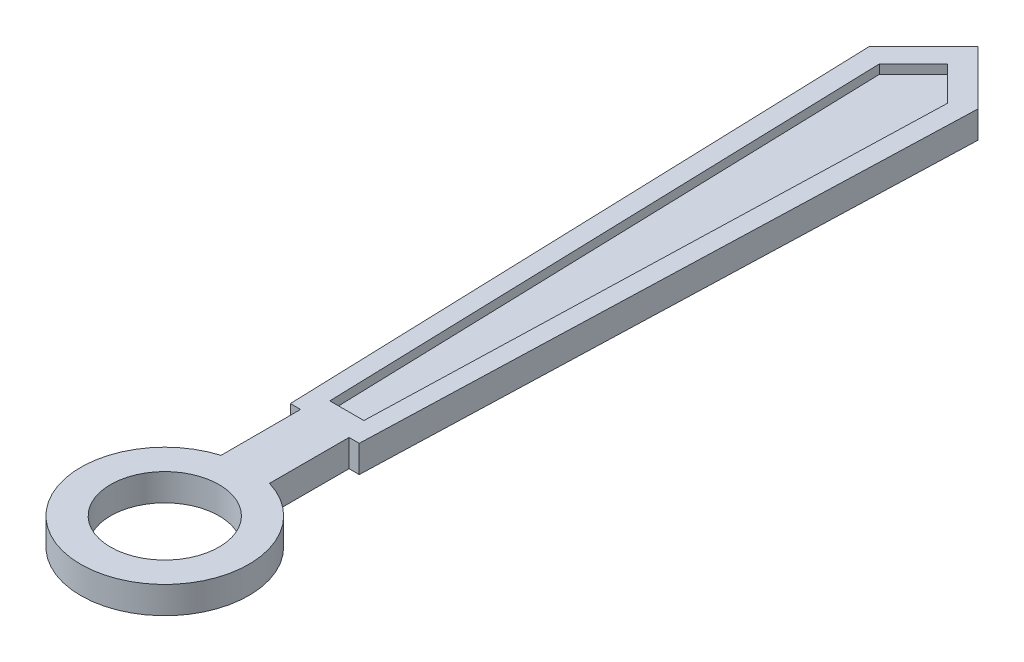
ISO-10303-21;
HEADER;
FILE_DESCRIPTION(('STEP AP214'),'2;1');
FILE_NAME('part.step','',(''),(''),'','','');
FILE_SCHEMA(('AUTOMOTIVE_DESIGN { 1 0 10303 214 1 1 1 1 }'));
ENDSEC;
DATA;
#1=APPLICATION_CONTEXT('core data for automotive mechanical design processes');
#2=APPLICATION_PROTOCOL_DEFINITION('international standard','automotive_design',2000,#1);
#3=PRODUCT_CONTEXT('',#1,'mechanical');
#4=PRODUCT('Part','Part','',(#3));
#5=PRODUCT_RELATED_PRODUCT_CATEGORY('part','',(#4));
#6=PRODUCT_DEFINITION_FORMATION('','',#4);
#7=PRODUCT_DEFINITION_CONTEXT('part definition',#1,'design');
#8=PRODUCT_DEFINITION('design','',#6,#7);
#9=PRODUCT_DEFINITION_SHAPE('','',#8);
#10=(LENGTH_UNIT() NAMED_UNIT(*) SI_UNIT(.MILLI.,.METRE.));
#11=(NAMED_UNIT(*) PLANE_ANGLE_UNIT() SI_UNIT($,.RADIAN.));
#12=(NAMED_UNIT(*) SI_UNIT($,.STERADIAN.) SOLID_ANGLE_UNIT());
#13=UNCERTAINTY_MEASURE_WITH_UNIT(LENGTH_MEASURE(1.E-05),#10,'distance_accuracy_value','');
#14=(GEOMETRIC_REPRESENTATION_CONTEXT(3) GLOBAL_UNCERTAINTY_ASSIGNED_CONTEXT((#13)) GLOBAL_UNIT_ASSIGNED_CONTEXT((#10,
#11,#12)) REPRESENTATION_CONTEXT('',''));
#15=CARTESIAN_POINT('',(0.,0.,0.));
#16=DIRECTION('',(0.,0.,1.));
#17=DIRECTION('',(1.,0.,0.));
#18=AXIS2_PLACEMENT_3D('',#15,#16,#17);
#19=CARTESIAN_POINT('',(-0.6,0.3,-8.40000000000001));
#20=DIRECTION('',(0.707106781186538,0.,0.707106781186557));
#21=DIRECTION('',(0.707106781186557,0.,-0.707106781186538));
#22=AXIS2_PLACEMENT_3D('',#19,#20,#21);
#23=PLANE('',#22);
#24=DIRECTION('',(-0.707106781186557,0.,0.707106781186538));
#25=VECTOR('',#24,1.);
#26=CARTESIAN_POINT('',(-0.6,0.,-8.40000000000001));
#27=LINE('',#26,#25);
#28=CARTESIAN_POINT('',(0.,0.,-9.));
#29=VERTEX_POINT('',#28);
#30=CARTESIAN_POINT('',(-0.6,0.,-8.40000000000001));
#31=VERTEX_POINT('',#30);
#32=EDGE_CURVE('E146',#29,#31,#27,.T.);
#33=ORIENTED_EDGE('',*,*,#32,.T.);
#34=DIRECTION('',(0.,-1.,0.));
#35=VECTOR('',#34,1.);
#36=CARTESIAN_POINT('',(-0.6,0.3,-8.40000000000001));
#37=LINE('',#36,#35);
#38=CARTESIAN_POINT('',(-0.6,0.3,-8.40000000000001));
#39=VERTEX_POINT('',#38);
#40=EDGE_CURVE('E11',#39,#31,#37,.T.);
#41=ORIENTED_EDGE('',*,*,#40,.F.);
#42=DIRECTION('',(-0.707106781186557,0.,0.707106781186538));
#43=VECTOR('',#42,1.);
#44=CARTESIAN_POINT('',(-0.6,0.3,-8.40000000000001));
#45=LINE('',#44,#43);
#46=CARTESIAN_POINT('',(0.,0.3,-9.));
#47=VERTEX_POINT('',#46);
#48=EDGE_CURVE('E164',#47,#39,#45,.T.);
#49=ORIENTED_EDGE('',*,*,#48,.F.);
#50=DIRECTION('',(0.,-1.,0.));
#51=VECTOR('',#50,1.);
#52=CARTESIAN_POINT('',(0.,0.3,-9.));
#53=LINE('',#52,#51);
#54=EDGE_CURVE('E142',#47,#29,#53,.T.);
#55=ORIENTED_EDGE('',*,*,#54,.T.);
#56=EDGE_LOOP('',(#33,#41,#49,#55));
#57=FACE_BOUND('',#56,.T.);
#58=ADVANCED_FACE('F32',(#57),#23,.F.);
#59=CARTESIAN_POINT('',(-0.6,0.3,-8.40000000000001));
#60=DIRECTION('',(0.999454722876177,0.,-0.0330190387580298));
#61=DIRECTION('',(-0.0330190387580298,0.,-0.999454722876177));
#62=AXIS2_PLACEMENT_3D('',#59,#60,#61);
#63=PLANE('',#62);
#64=DIRECTION('',(0.0330190387580298,0.,0.999454722876177));
#65=VECTOR('',#64,1.);
#66=CARTESIAN_POINT('',(-0.6,0.,-8.40000000000001));
#67=LINE('',#66,#65);
#68=CARTESIAN_POINT('',(-0.380994593849391,0.,-1.77091581869836));
#69=VERTEX_POINT('',#68);
#70=EDGE_CURVE('E149',#31,#69,#67,.T.);
#71=ORIENTED_EDGE('',*,*,#70,.T.);
#72=DIRECTION('',(0.,-1.,0.));
#73=VECTOR('',#72,1.);
#74=CARTESIAN_POINT('',(-0.380994593849391,0.3,-1.77091581869836));
#75=LINE('',#74,#73);
#76=CARTESIAN_POINT('',(-0.380994593849391,0.3,-1.77091581869836));
#77=VERTEX_POINT('',#76);
#78=EDGE_CURVE('E39',#77,#69,#75,.T.);
#79=ORIENTED_EDGE('',*,*,#78,.F.);
#80=DIRECTION('',(0.0330190387580298,0.,0.999454722876177));
#81=VECTOR('',#80,1.);
#82=CARTESIAN_POINT('',(-0.6,0.3,-8.40000000000001));
#83=LINE('',#82,#81);
#84=EDGE_CURVE('E99',#39,#77,#83,.T.);
#85=ORIENTED_EDGE('',*,*,#84,.F.);
#86=ORIENTED_EDGE('',*,*,#40,.T.);
#87=EDGE_LOOP('',(#71,#79,#85,#86));
#88=FACE_BOUND('',#87,.T.);
#89=ADVANCED_FACE('F299',(#88),#63,.F.);
#90=CARTESIAN_POINT('',(-0.380994593849391,0.3,-1.77091581869836));
#91=DIRECTION('',(0.,0.,-1.));
#92=DIRECTION('',(-1.,0.,0.));
#93=AXIS2_PLACEMENT_3D('',#90,#91,#92);
#94=PLANE('',#93);
#95=DIRECTION('',(1.,0.,0.));
#96=VECTOR('',#95,1.);
#97=CARTESIAN_POINT('',(-0.380994593849391,0.,-1.77091581869836));
#98=LINE('',#97,#96);
#99=CARTESIAN_POINT('',(-0.268357858199973,0.,-1.77091581869836));
#100=VERTEX_POINT('',#99);
#101=EDGE_CURVE('E152',#69,#100,#98,.T.);
#102=ORIENTED_EDGE('',*,*,#101,.T.);
#103=DIRECTION('',(0.,-1.,0.));
#104=VECTOR('',#103,1.);
#105=CARTESIAN_POINT('',(-0.268357858199973,0.3,-1.77091581869836));
#106=LINE('',#105,#104);
#107=CARTESIAN_POINT('',(-0.268357858199973,0.3,-1.77091581869836));
#108=VERTEX_POINT('',#107);
#109=EDGE_CURVE('E174',#108,#100,#106,.T.);
#110=ORIENTED_EDGE('',*,*,#109,.F.);
#111=DIRECTION('',(1.,0.,0.));
#112=VECTOR('',#111,1.);
#113=CARTESIAN_POINT('',(-0.380994593849391,0.3,-1.77091581869836));
#114=LINE('',#113,#112);
#115=EDGE_CURVE('E182',#77,#108,#114,.T.);
#116=ORIENTED_EDGE('',*,*,#115,.F.);
#117=ORIENTED_EDGE('',*,*,#78,.T.);
#118=EDGE_LOOP('',(#102,#110,#116,#117));
#119=FACE_BOUND('',#118,.T.);
#120=ADVANCED_FACE('F180',(#119),#94,.F.);
#121=CARTESIAN_POINT('',(-0.268357858199973,0.3,-1.77091581869836));
#122=DIRECTION('',(1.,0.,0.));
#123=DIRECTION('',(0.,0.,-1.));
#124=AXIS2_PLACEMENT_3D('',#121,#122,#123);
#125=PLANE('',#124);
#126=DIRECTION('',(0.,0.,1.));
#127=VECTOR('',#126,1.);
#128=CARTESIAN_POINT('',(-0.268357858199973,0.,-1.77091581869836));
#129=LINE('',#128,#127);
#130=CARTESIAN_POINT('',(-0.268357858199973,0.,-0.890872099888053));
#131=VERTEX_POINT('',#130);
#132=EDGE_CURVE('E154',#100,#131,#129,.T.);
#133=ORIENTED_EDGE('',*,*,#132,.T.);
#134=DIRECTION('',(0.,-1.,0.));
#135=VECTOR('',#134,1.);
#136=CARTESIAN_POINT('',(-0.268357858199973,0.3,-0.890872099888053));
#137=LINE('',#136,#135);
#138=CARTESIAN_POINT('',(-0.268357858199973,0.3,-0.890872099888053));
#139=VERTEX_POINT('',#138);
#140=EDGE_CURVE('E171',#139,#131,#137,.T.);
#141=ORIENTED_EDGE('',*,*,#140,.F.);
#142=DIRECTION('',(0.,0.,1.));
#143=VECTOR('',#142,1.);
#144=CARTESIAN_POINT('',(-0.268357858199973,0.3,-1.77091581869836));
#145=LINE('',#144,#143);
#146=EDGE_CURVE('E198',#108,#139,#145,.T.);
#147=ORIENTED_EDGE('',*,*,#146,.F.);
#148=ORIENTED_EDGE('',*,*,#109,.T.);
#149=EDGE_LOOP('',(#133,#141,#147,#148));
#150=FACE_BOUND('',#149,.T.);
#151=ADVANCED_FACE('F191',(#150),#125,.F.);
#152=CARTESIAN_POINT('',(0.,0.3,0.));
#153=DIRECTION('',(0.,-1.,0.));
#154=DIRECTION('',(0.,0.,-1.));
#155=AXIS2_PLACEMENT_3D('',#152,#153,#154);
#156=CYLINDRICAL_SURFACE('',#155,0.930413369646323);
#157=CARTESIAN_POINT('',(0.,0.,0.));
#158=DIRECTION('',(0.,1.,0.));
#159=DIRECTION('',(0.,0.,1.));
#160=AXIS2_PLACEMENT_3D('',#157,#158,#159);
#161=CIRCLE('',#160,0.930413369646323);
#162=CARTESIAN_POINT('',(0.268357858199973,0.,-0.890872099888053));
#163=VERTEX_POINT('',#162);
#164=EDGE_CURVE('E156',#131,#163,#161,.T.);
#165=ORIENTED_EDGE('',*,*,#164,.T.);
#166=DIRECTION('',(0.,-1.,0.));
#167=VECTOR('',#166,1.);
#168=CARTESIAN_POINT('',(0.268357858199973,0.3,-0.890872099888053));
#169=LINE('',#168,#167);
#170=CARTESIAN_POINT('',(0.268357858199973,0.3,-0.890872099888053));
#171=VERTEX_POINT('',#170);
#172=EDGE_CURVE('E168',#171,#163,#169,.T.);
#173=ORIENTED_EDGE('',*,*,#172,.F.);
#174=CARTESIAN_POINT('',(0.,0.3,0.));
#175=DIRECTION('',(0.,1.,0.));
#176=DIRECTION('',(0.,0.,1.));
#177=AXIS2_PLACEMENT_3D('',#174,#175,#176);
#178=CIRCLE('',#177,0.930413369646323);
#179=EDGE_CURVE('E197',#139,#171,#178,.T.);
#180=ORIENTED_EDGE('',*,*,#179,.F.);
#181=ORIENTED_EDGE('',*,*,#140,.T.);
#182=EDGE_LOOP('',(#165,#173,#180,#181));
#183=FACE_BOUND('',#182,.T.);
#184=ADVANCED_FACE('F195',(#183),#156,.T.);
#185=CARTESIAN_POINT('',(0.268357858199973,0.3,-1.77091581869836));
#186=DIRECTION('',(-1.,0.,0.));
#187=DIRECTION('',(0.,0.,1.));
#188=AXIS2_PLACEMENT_3D('',#185,#186,#187);
#189=PLANE('',#188);
#190=DIRECTION('',(0.,0.,-1.));
#191=VECTOR('',#190,1.);
#192=CARTESIAN_POINT('',(0.268357858199973,0.,-1.77091581869836));
#193=LINE('',#192,#191);
#194=CARTESIAN_POINT('',(0.268357858199973,0.,-1.77091581869836));
#195=VERTEX_POINT('',#194);
#196=EDGE_CURVE('E158',#163,#195,#193,.T.);
#197=ORIENTED_EDGE('',*,*,#196,.T.);
#198=DIRECTION('',(0.,-1.,0.));
#199=VECTOR('',#198,1.);
#200=CARTESIAN_POINT('',(0.268357858199973,0.3,-1.77091581869836));
#201=LINE('',#200,#199);
#202=CARTESIAN_POINT('',(0.268357858199973,0.3,-1.77091581869836));
#203=VERTEX_POINT('',#202);
#204=EDGE_CURVE('E137',#203,#195,#201,.T.);
#205=ORIENTED_EDGE('',*,*,#204,.F.);
#206=DIRECTION('',(0.,0.,-1.));
#207=VECTOR('',#206,1.);
#208=CARTESIAN_POINT('',(0.268357858199973,0.3,-1.77091581869836));
#209=LINE('',#208,#207);
#210=EDGE_CURVE('E125',#171,#203,#209,.T.);
#211=ORIENTED_EDGE('',*,*,#210,.F.);
#212=ORIENTED_EDGE('',*,*,#172,.T.);
#213=EDGE_LOOP('',(#197,#205,#211,#212));
#214=FACE_BOUND('',#213,.T.);
#215=ADVANCED_FACE('F320',(#214),#189,.F.);
#216=CARTESIAN_POINT('',(0.380994593849391,0.3,-1.77091581869836));
#217=DIRECTION('',(0.,0.,-1.));
#218=DIRECTION('',(-1.,0.,0.));
#219=AXIS2_PLACEMENT_3D('',#216,#217,#218);
#220=PLANE('',#219);
#221=DIRECTION('',(1.,0.,0.));
#222=VECTOR('',#221,1.);
#223=CARTESIAN_POINT('',(0.380994593849391,0.,-1.77091581869836));
#224=LINE('',#223,#222);
#225=CARTESIAN_POINT('',(0.380994593849391,0.,-1.77091581869836));
#226=VERTEX_POINT('',#225);
#227=EDGE_CURVE('E134',#195,#226,#224,.T.);
#228=ORIENTED_EDGE('',*,*,#227,.T.);
#229=DIRECTION('',(0.,-1.,0.));
#230=VECTOR('',#229,1.);
#231=CARTESIAN_POINT('',(0.380994593849391,0.3,-1.77091581869836));
#232=LINE('',#231,#230);
#233=CARTESIAN_POINT('',(0.380994593849391,0.3,-1.77091581869836));
#234=VERTEX_POINT('',#233);
#235=EDGE_CURVE('E131',#234,#226,#232,.T.);
#236=ORIENTED_EDGE('',*,*,#235,.F.);
#237=DIRECTION('',(1.,0.,0.));
#238=VECTOR('',#237,1.);
#239=CARTESIAN_POINT('',(0.380994593849391,0.3,-1.77091581869836));
#240=LINE('',#239,#238);
#241=EDGE_CURVE('E118',#203,#234,#240,.T.);
#242=ORIENTED_EDGE('',*,*,#241,.F.);
#243=ORIENTED_EDGE('',*,*,#204,.T.);
#244=EDGE_LOOP('',(#228,#236,#242,#243));
#245=FACE_BOUND('',#244,.T.);
#246=ADVANCED_FACE('F132',(#245),#220,.F.);
#247=CARTESIAN_POINT('',(0.6,0.3,-8.40000000000001));
#248=DIRECTION('',(-0.999454722876177,0.,-0.0330190387580299));
#249=DIRECTION('',(-0.0330190387580299,0.,0.999454722876177));
#250=AXIS2_PLACEMENT_3D('',#247,#248,#249);
#251=PLANE('',#250);
#252=DIRECTION('',(0.0330190387580299,0.,-0.999454722876177));
#253=VECTOR('',#252,1.);
#254=CARTESIAN_POINT('',(0.6,0.,-8.40000000000001));
#255=LINE('',#254,#253);
#256=CARTESIAN_POINT('',(0.6,0.,-8.40000000000001));
#257=VERTEX_POINT('',#256);
#258=EDGE_CURVE('E161',#226,#257,#255,.T.);
#259=ORIENTED_EDGE('',*,*,#258,.T.);
#260=DIRECTION('',(0.,-1.,0.));
#261=VECTOR('',#260,1.);
#262=CARTESIAN_POINT('',(0.6,0.3,-8.40000000000001));
#263=LINE('',#262,#261);
#264=CARTESIAN_POINT('',(0.6,0.3,-8.40000000000001));
#265=VERTEX_POINT('',#264);
#266=EDGE_CURVE('E138',#265,#257,#263,.T.);
#267=ORIENTED_EDGE('',*,*,#266,.F.);
#268=DIRECTION('',(0.0330190387580299,0.,-0.999454722876177));
#269=VECTOR('',#268,1.);
#270=CARTESIAN_POINT('',(0.6,0.3,-8.40000000000001));
#271=LINE('',#270,#269);
#272=EDGE_CURVE('E122',#234,#265,#271,.T.);
#273=ORIENTED_EDGE('',*,*,#272,.F.);
#274=ORIENTED_EDGE('',*,*,#235,.T.);
#275=EDGE_LOOP('',(#259,#267,#273,#274));
#276=FACE_BOUND('',#275,.T.);
#277=ADVANCED_FACE('F140',(#276),#251,.F.);
#278=CARTESIAN_POINT('',(0.,0.3,-9.));
#279=DIRECTION('',(-0.707106781186538,0.,0.707106781186557));
#280=DIRECTION('',(0.707106781186557,0.,0.707106781186538));
#281=AXIS2_PLACEMENT_3D('',#278,#279,#280);
#282=PLANE('',#281);
#283=DIRECTION('',(-0.707106781186557,0.,-0.707106781186538));
#284=VECTOR('',#283,1.);
#285=CARTESIAN_POINT('',(0.,0.,-9.));
#286=LINE('',#285,#284);
#287=EDGE_CURVE('E91',#257,#29,#286,.T.);
#288=ORIENTED_EDGE('',*,*,#287,.T.);
#289=ORIENTED_EDGE('',*,*,#54,.F.);
#290=DIRECTION('',(-0.707106781186557,0.,-0.707106781186538));
#291=VECTOR('',#290,1.);
#292=CARTESIAN_POINT('',(0.,0.3,-9.));
#293=LINE('',#292,#291);
#294=EDGE_CURVE('E55',#265,#47,#293,.T.);
#295=ORIENTED_EDGE('',*,*,#294,.F.);
#296=ORIENTED_EDGE('',*,*,#266,.T.);
#297=EDGE_LOOP('',(#288,#289,#295,#296));
#298=FACE_BOUND('',#297,.T.);
#299=ADVANCED_FACE('F306',(#298),#282,.F.);
#300=CARTESIAN_POINT('',(0.,0.3,0.));
#301=DIRECTION('',(0.,1.,0.));
#302=DIRECTION('',(0.,0.,1.));
#303=AXIS2_PLACEMENT_3D('',#300,#301,#302);
#304=PLANE('',#303);
#305=DIRECTION('',(-0.707106781186556,0.,0.707106781186538));
#306=VECTOR('',#305,1.);
#307=CARTESIAN_POINT('',(0.,0.3,-8.66256312087284));
#308=LINE('',#307,#306);
#309=CARTESIAN_POINT('',(0.,0.3,-8.66256312087284));
#310=VERTEX_POINT('',#309);
#311=CARTESIAN_POINT('',(-0.37718326942347,0.3,-8.28537985144938));
#312=VERTEX_POINT('',#311);
#313=EDGE_CURVE('E46',#310,#312,#308,.T.);
#314=ORIENTED_EDGE('',*,*,#313,.F.);
#315=DIRECTION('',(-0.707106781186556,0.,-0.707106781186538));
#316=VECTOR('',#315,1.);
#317=CARTESIAN_POINT('',(0.,0.3,-8.66256312087284));
#318=LINE('',#317,#316);
#319=CARTESIAN_POINT('',(0.37718326942347,0.3,-8.28537985144938));
#320=VERTEX_POINT('',#319);
#321=EDGE_CURVE('E224',#320,#310,#318,.T.);
#322=ORIENTED_EDGE('',*,*,#321,.F.);
#323=DIRECTION('',(0.0300623403344006,0.,-0.999548025706428));
#324=VECTOR('',#323,1.);
#325=CARTESIAN_POINT('',(0.37718326942347,0.3,-8.28537985144938));
#326=LINE('',#325,#324);
#327=CARTESIAN_POINT('',(0.188591634711735,0.3,-2.01486351626063));
#328=VERTEX_POINT('',#327);
#329=EDGE_CURVE('E228',#328,#320,#326,.T.);
#330=ORIENTED_EDGE('',*,*,#329,.F.);
#331=DIRECTION('',(1.,0.,0.));
#332=VECTOR('',#331,1.);
#333=CARTESIAN_POINT('',(0.188591634711735,0.3,-2.01486351626063));
#334=LINE('',#333,#332);
#335=CARTESIAN_POINT('',(-0.188591634711735,0.3,-2.01486351626063));
#336=VERTEX_POINT('',#335);
#337=EDGE_CURVE('E231',#336,#328,#334,.T.);
#338=ORIENTED_EDGE('',*,*,#337,.F.);
#339=DIRECTION('',(0.0300623403344006,0.,0.999548025706428));
#340=VECTOR('',#339,1.);
#341=CARTESIAN_POINT('',(-0.37718326942347,0.3,-8.28537985144938));
#342=LINE('',#341,#340);
#343=EDGE_CURVE('E234',#312,#336,#342,.T.);
#344=ORIENTED_EDGE('',*,*,#343,.F.);
#345=EDGE_LOOP('',(#314,#322,#330,#338,#344));
#346=FACE_BOUND('',#345,.T.);
#347=CARTESIAN_POINT('',(0.,0.3,0.));
#348=DIRECTION('',(0.,1.,0.));
#349=DIRECTION('',(0.,0.,1.));
#350=AXIS2_PLACEMENT_3D('',#347,#348,#349);
#351=CIRCLE('',#350,0.6);
#352=CARTESIAN_POINT('',(0.,0.3,0.6));
#353=VERTEX_POINT('',#352);
#354=EDGE_CURVE('E150',#353,#353,#351,.T.);
#355=ORIENTED_EDGE('',*,*,#354,.F.);
#356=EDGE_LOOP('',(#355));
#357=FACE_BOUND('',#356,.T.);
#358=ORIENTED_EDGE('',*,*,#48,.T.);
#359=ORIENTED_EDGE('',*,*,#84,.T.);
#360=ORIENTED_EDGE('',*,*,#115,.T.);
#361=ORIENTED_EDGE('',*,*,#146,.T.);
#362=ORIENTED_EDGE('',*,*,#179,.T.);
#363=ORIENTED_EDGE('',*,*,#210,.T.);
#364=ORIENTED_EDGE('',*,*,#241,.T.);
#365=ORIENTED_EDGE('',*,*,#272,.T.);
#366=ORIENTED_EDGE('',*,*,#294,.T.);
#367=EDGE_LOOP('',(#358,#359,#360,#361,#362,#363,#364,#365,#366));
#368=FACE_BOUND('',#367,.T.);
#369=ADVANCED_FACE('F120',(#346,#357,#368),#304,.T.);
#370=CARTESIAN_POINT('',(0.,0.,0.));
#371=DIRECTION('',(0.,1.,0.));
#372=DIRECTION('',(0.,0.,1.));
#373=AXIS2_PLACEMENT_3D('',#370,#371,#372);
#374=PLANE('',#373);
#375=CARTESIAN_POINT('',(0.,0.,0.));
#376=DIRECTION('',(0.,1.,0.));
#377=DIRECTION('',(0.,0.,1.));
#378=AXIS2_PLACEMENT_3D('',#375,#376,#377);
#379=CIRCLE('',#378,0.6);
#380=CARTESIAN_POINT('',(0.,0.,0.6));
#381=VERTEX_POINT('',#380);
#382=EDGE_CURVE('E205',#381,#381,#379,.T.);
#383=ORIENTED_EDGE('',*,*,#382,.T.);
#384=EDGE_LOOP('',(#383));
#385=FACE_BOUND('',#384,.T.);
#386=ORIENTED_EDGE('',*,*,#32,.F.);
#387=ORIENTED_EDGE('',*,*,#287,.F.);
#388=ORIENTED_EDGE('',*,*,#258,.F.);
#389=ORIENTED_EDGE('',*,*,#227,.F.);
#390=ORIENTED_EDGE('',*,*,#196,.F.);
#391=ORIENTED_EDGE('',*,*,#164,.F.);
#392=ORIENTED_EDGE('',*,*,#132,.F.);
#393=ORIENTED_EDGE('',*,*,#101,.F.);
#394=ORIENTED_EDGE('',*,*,#70,.F.);
#395=EDGE_LOOP('',(#386,#387,#388,#389,#390,#391,#392,#393,#394));
#396=FACE_BOUND('',#395,.T.);
#397=ADVANCED_FACE('F186',(#385,#396),#374,.F.);
#398=CARTESIAN_POINT('',(0.,0.3,0.));
#399=DIRECTION('',(0.,-1.,0.));
#400=DIRECTION('',(0.,0.,-1.));
#401=AXIS2_PLACEMENT_3D('',#398,#399,#400);
#402=CYLINDRICAL_SURFACE('',#401,0.6);
#403=ORIENTED_EDGE('',*,*,#354,.T.);
#404=EDGE_LOOP('',(#403));
#405=FACE_BOUND('',#404,.T.);
#406=ORIENTED_EDGE('',*,*,#382,.F.);
#407=EDGE_LOOP('',(#406));
#408=FACE_BOUND('',#407,.T.);
#409=ADVANCED_FACE('F367',(#405,#408),#402,.F.);
#410=CARTESIAN_POINT('',(0.,0.2,-8.66256312087284));
#411=DIRECTION('',(-0.707106781186538,0.,-0.707106781186556));
#412=DIRECTION('',(-0.707106781186557,0.,0.707106781186539));
#413=AXIS2_PLACEMENT_3D('',#410,#411,#412);
#414=PLANE('',#413);
#415=ORIENTED_EDGE('',*,*,#313,.T.);
#416=DIRECTION('',(0.,1.,0.));
#417=VECTOR('',#416,1.);
#418=CARTESIAN_POINT('',(-0.37718326942347,0.2,-8.28537985144938));
#419=LINE('',#418,#417);
#420=CARTESIAN_POINT('',(-0.37718326942347,0.2,-8.28537985144938));
#421=VERTEX_POINT('',#420);
#422=EDGE_CURVE('E211',#421,#312,#419,.T.);
#423=ORIENTED_EDGE('',*,*,#422,.F.);
#424=DIRECTION('',(-0.707106781186556,0.,0.707106781186538));
#425=VECTOR('',#424,1.);
#426=CARTESIAN_POINT('',(0.,0.2,-8.66256312087284));
#427=LINE('',#426,#425);
#428=CARTESIAN_POINT('',(0.,0.2,-8.66256312087284));
#429=VERTEX_POINT('',#428);
#430=EDGE_CURVE('E227',#429,#421,#427,.T.);
#431=ORIENTED_EDGE('',*,*,#430,.F.);
#432=DIRECTION('',(0.,1.,0.));
#433=VECTOR('',#432,1.);
#434=CARTESIAN_POINT('',(0.,0.2,-8.66256312087284));
#435=LINE('',#434,#433);
#436=EDGE_CURVE('E208',#429,#310,#435,.T.);
#437=ORIENTED_EDGE('',*,*,#436,.T.);
#438=EDGE_LOOP('',(#415,#423,#431,#437));
#439=FACE_BOUND('',#438,.T.);
#440=ADVANCED_FACE('F258',(#439),#414,.F.);
#441=CARTESIAN_POINT('',(0.,0.2,-8.66256312087284));
#442=DIRECTION('',(0.707106781186538,0.,-0.707106781186556));
#443=DIRECTION('',(-0.707106781186557,0.,-0.707106781186539));
#444=AXIS2_PLACEMENT_3D('',#441,#442,#443);
#445=PLANE('',#444);
#446=ORIENTED_EDGE('',*,*,#321,.T.);
#447=ORIENTED_EDGE('',*,*,#436,.F.);
#448=DIRECTION('',(-0.707106781186556,0.,-0.707106781186538));
#449=VECTOR('',#448,1.);
#450=CARTESIAN_POINT('',(0.,0.2,-8.66256312087284));
#451=LINE('',#450,#449);
#452=CARTESIAN_POINT('',(0.37718326942347,0.2,-8.28537985144938));
#453=VERTEX_POINT('',#452);
#454=EDGE_CURVE('E214',#453,#429,#451,.T.);
#455=ORIENTED_EDGE('',*,*,#454,.F.);
#456=DIRECTION('',(0.,1.,0.));
#457=VECTOR('',#456,1.);
#458=CARTESIAN_POINT('',(0.37718326942347,0.2,-8.28537985144938));
#459=LINE('',#458,#457);
#460=EDGE_CURVE('E220',#453,#320,#459,.T.);
#461=ORIENTED_EDGE('',*,*,#460,.T.);
#462=EDGE_LOOP('',(#446,#447,#455,#461));
#463=FACE_BOUND('',#462,.T.);
#464=ADVANCED_FACE('F272',(#463),#445,.F.);
#465=CARTESIAN_POINT('',(0.37718326942347,0.2,-8.28537985144938));
#466=DIRECTION('',(0.999548025706428,0.,0.0300623403344006));
#467=DIRECTION('',(0.0300623403344006,0.,-0.999548025706428));
#468=AXIS2_PLACEMENT_3D('',#465,#466,#467);
#469=PLANE('',#468);
#470=ORIENTED_EDGE('',*,*,#329,.T.);
#471=ORIENTED_EDGE('',*,*,#460,.F.);
#472=DIRECTION('',(0.0300623403344006,0.,-0.999548025706428));
#473=VECTOR('',#472,1.);
#474=CARTESIAN_POINT('',(0.37718326942347,0.2,-8.28537985144938));
#475=LINE('',#474,#473);
#476=CARTESIAN_POINT('',(0.188591634711735,0.2,-2.01486351626063));
#477=VERTEX_POINT('',#476);
#478=EDGE_CURVE('E240',#477,#453,#475,.T.);
#479=ORIENTED_EDGE('',*,*,#478,.F.);
#480=DIRECTION('',(0.,1.,0.));
#481=VECTOR('',#480,1.);
#482=CARTESIAN_POINT('',(0.188591634711735,0.2,-2.01486351626063));
#483=LINE('',#482,#481);
#484=EDGE_CURVE('E217',#477,#328,#483,.T.);
#485=ORIENTED_EDGE('',*,*,#484,.T.);
#486=EDGE_LOOP('',(#470,#471,#479,#485));
#487=FACE_BOUND('',#486,.T.);
#488=ADVANCED_FACE('F277',(#487),#469,.F.);
#489=CARTESIAN_POINT('',(0.188591634711735,0.2,-2.01486351626063));
#490=DIRECTION('',(0.,0.,1.));
#491=DIRECTION('',(1.,0.,0.));
#492=AXIS2_PLACEMENT_3D('',#489,#490,#491);
#493=PLANE('',#492);
#494=ORIENTED_EDGE('',*,*,#337,.T.);
#495=ORIENTED_EDGE('',*,*,#484,.F.);
#496=DIRECTION('',(1.,0.,0.));
#497=VECTOR('',#496,1.);
#498=CARTESIAN_POINT('',(0.188591634711735,0.2,-2.01486351626063));
#499=LINE('',#498,#497);
#500=CARTESIAN_POINT('',(-0.188591634711735,0.2,-2.01486351626063));
#501=VERTEX_POINT('',#500);
#502=EDGE_CURVE('E243',#501,#477,#499,.T.);
#503=ORIENTED_EDGE('',*,*,#502,.F.);
#504=DIRECTION('',(0.,1.,0.));
#505=VECTOR('',#504,1.);
#506=CARTESIAN_POINT('',(-0.188591634711735,0.2,-2.01486351626063));
#507=LINE('',#506,#505);
#508=EDGE_CURVE('E213',#501,#336,#507,.T.);
#509=ORIENTED_EDGE('',*,*,#508,.T.);
#510=EDGE_LOOP('',(#494,#495,#503,#509));
#511=FACE_BOUND('',#510,.T.);
#512=ADVANCED_FACE('F289',(#511),#493,.F.);
#513=CARTESIAN_POINT('',(-0.37718326942347,0.2,-8.28537985144938));
#514=DIRECTION('',(-0.999548025706428,0.,0.0300623403344006));
#515=DIRECTION('',(0.0300623403344006,0.,0.999548025706428));
#516=AXIS2_PLACEMENT_3D('',#513,#514,#515);
#517=PLANE('',#516);
#518=ORIENTED_EDGE('',*,*,#343,.T.);
#519=ORIENTED_EDGE('',*,*,#508,.F.);
#520=DIRECTION('',(0.0300623403344006,0.,0.999548025706428));
#521=VECTOR('',#520,1.);
#522=CARTESIAN_POINT('',(-0.37718326942347,0.2,-8.28537985144938));
#523=LINE('',#522,#521);
#524=EDGE_CURVE('E246',#421,#501,#523,.T.);
#525=ORIENTED_EDGE('',*,*,#524,.F.);
#526=ORIENTED_EDGE('',*,*,#422,.T.);
#527=EDGE_LOOP('',(#518,#519,#525,#526));
#528=FACE_BOUND('',#527,.T.);
#529=ADVANCED_FACE('F285',(#528),#517,.F.);
#530=CARTESIAN_POINT('',(0.,0.2,0.));
#531=DIRECTION('',(0.,1.,0.));
#532=DIRECTION('',(0.,0.,1.));
#533=AXIS2_PLACEMENT_3D('',#530,#531,#532);
#534=PLANE('',#533);
#535=ORIENTED_EDGE('',*,*,#430,.T.);
#536=ORIENTED_EDGE('',*,*,#524,.T.);
#537=ORIENTED_EDGE('',*,*,#502,.T.);
#538=ORIENTED_EDGE('',*,*,#478,.T.);
#539=ORIENTED_EDGE('',*,*,#454,.T.);
#540=EDGE_LOOP('',(#535,#536,#537,#538,#539));
#541=FACE_BOUND('',#540,.T.);
#542=ADVANCED_FACE('F253',(#541),#534,.T.);
#543=CLOSED_SHELL('',(#58,#89,#120,#151,#184,#215,#246,#277,#299,#369,#397,#409,#440,#464,#488,
#512,#529,#542));
#544=MANIFOLD_SOLID_BREP('B2',#543);
#545=ADVANCED_BREP_SHAPE_REPRESENTATION('',(#18,#544),#14);
#546=SHAPE_DEFINITION_REPRESENTATION(#9,#545);
ENDSEC;
END-ISO-10303-21;
